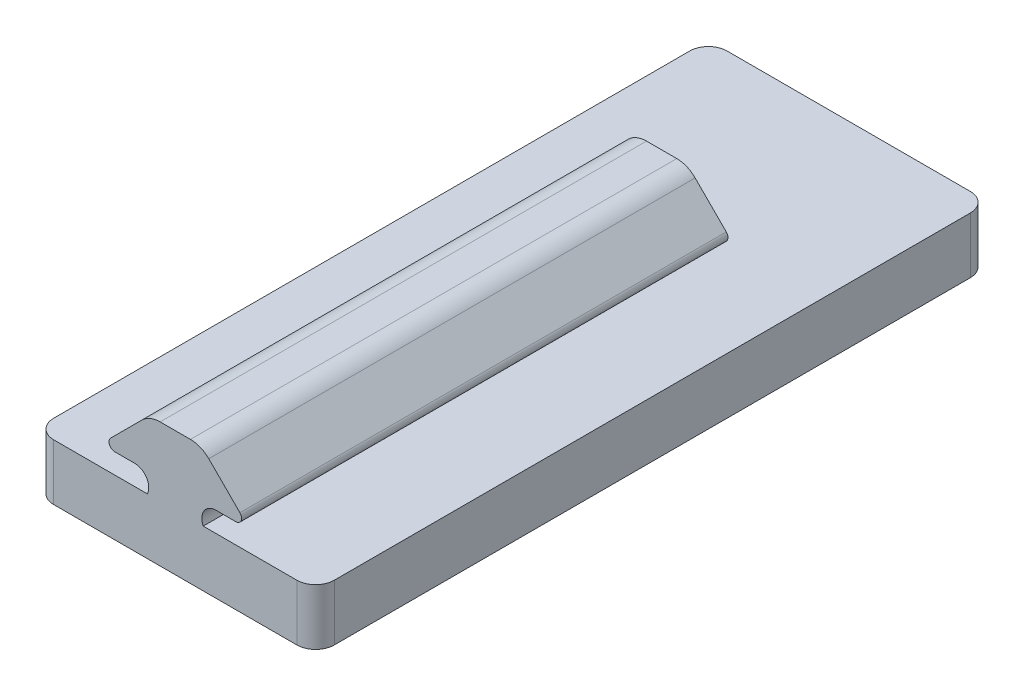
ISO-10303-21;
HEADER;
FILE_DESCRIPTION(('STEP AP214'),'2;1');
FILE_NAME('part.step','',(''),(''),'','','');
FILE_SCHEMA(('AUTOMOTIVE_DESIGN { 1 0 10303 214 1 1 1 1 }'));
ENDSEC;
DATA;
#1=APPLICATION_CONTEXT('core data for automotive mechanical design processes');
#2=APPLICATION_PROTOCOL_DEFINITION('international standard','automotive_design',2000,#1);
#3=PRODUCT_CONTEXT('',#1,'mechanical');
#4=PRODUCT('Part','Part','',(#3));
#5=PRODUCT_RELATED_PRODUCT_CATEGORY('part','',(#4));
#6=PRODUCT_DEFINITION_FORMATION('','',#4);
#7=PRODUCT_DEFINITION_CONTEXT('part definition',#1,'design');
#8=PRODUCT_DEFINITION('design','',#6,#7);
#9=PRODUCT_DEFINITION_SHAPE('','',#8);
#10=(LENGTH_UNIT() NAMED_UNIT(*) SI_UNIT(.MILLI.,.METRE.));
#11=(NAMED_UNIT(*) PLANE_ANGLE_UNIT() SI_UNIT($,.RADIAN.));
#12=(NAMED_UNIT(*) SI_UNIT($,.STERADIAN.) SOLID_ANGLE_UNIT());
#13=UNCERTAINTY_MEASURE_WITH_UNIT(LENGTH_MEASURE(1.E-05),#10,'distance_accuracy_value','');
#14=(GEOMETRIC_REPRESENTATION_CONTEXT(3) GLOBAL_UNCERTAINTY_ASSIGNED_CONTEXT((#13)) GLOBAL_UNIT_ASSIGNED_CONTEXT((#10,
#11,#12)) REPRESENTATION_CONTEXT('',''));
#15=CARTESIAN_POINT('',(0.,0.,0.));
#16=DIRECTION('',(0.,0.,1.));
#17=DIRECTION('',(1.,0.,0.));
#18=AXIS2_PLACEMENT_3D('',#15,#16,#17);
#19=CARTESIAN_POINT('',(13.,6.,-34.));
#20=DIRECTION('',(0.,-1.,0.));
#21=DIRECTION('',(0.,0.,-1.));
#22=AXIS2_PLACEMENT_3D('',#19,#20,#21);
#23=PLANE('',#22);
#24=DIRECTION('',(0.,0.,1.));
#25=VECTOR('',#24,1.);
#26=CARTESIAN_POINT('',(-2.98550279974351,6.,-16.));
#27=LINE('',#26,#25);
#28=CARTESIAN_POINT('',(-2.98550279974351,6.,-16.));
#29=VERTEX_POINT('',#28);
#30=CARTESIAN_POINT('',(-2.98550279974351,6.,36.));
#31=VERTEX_POINT('',#30);
#32=EDGE_CURVE('E12',#29,#31,#27,.T.);
#33=ORIENTED_EDGE('',*,*,#32,.F.);
#34=DIRECTION('',(-1.,0.,0.));
#35=VECTOR('',#34,1.);
#36=CARTESIAN_POINT('',(13.,6.,-16.));
#37=LINE('',#36,#35);
#38=CARTESIAN_POINT('',(2.98629677256727,6.,-16.));
#39=VERTEX_POINT('',#38);
#40=EDGE_CURVE('E288',#39,#29,#37,.T.);
#41=ORIENTED_EDGE('',*,*,#40,.F.);
#42=DIRECTION('',(0.,0.,1.));
#43=VECTOR('',#42,1.);
#44=CARTESIAN_POINT('',(2.98629677256727,6.,-16.));
#45=LINE('',#44,#43);
#46=CARTESIAN_POINT('',(2.98629677256727,6.,36.));
#47=VERTEX_POINT('',#46);
#48=EDGE_CURVE('E281',#47,#39,#45,.F.);
#49=ORIENTED_EDGE('',*,*,#48,.F.);
#50=DIRECTION('',(1.,0.,0.));
#51=VECTOR('',#50,1.);
#52=CARTESIAN_POINT('',(-13.,6.,36.));
#53=LINE('',#52,#51);
#54=CARTESIAN_POINT('',(13.,6.,36.));
#55=VERTEX_POINT('',#54);
#56=EDGE_CURVE('E524',#47,#55,#53,.T.);
#57=ORIENTED_EDGE('',*,*,#56,.T.);
#58=CARTESIAN_POINT('',(13.,6.,34.));
#59=DIRECTION('',(0.,1.,0.));
#60=DIRECTION('',(0.,0.,1.));
#61=AXIS2_PLACEMENT_3D('',#58,#59,#60);
#62=CIRCLE('',#61,2.);
#63=CARTESIAN_POINT('',(15.,6.,34.));
#64=VERTEX_POINT('',#63);
#65=EDGE_CURVE('E527',#55,#64,#62,.T.);
#66=ORIENTED_EDGE('',*,*,#65,.T.);
#67=DIRECTION('',(0.,0.,-1.));
#68=VECTOR('',#67,1.);
#69=CARTESIAN_POINT('',(15.,6.,-34.));
#70=LINE('',#69,#68);
#71=CARTESIAN_POINT('',(15.,6.,-34.));
#72=VERTEX_POINT('',#71);
#73=EDGE_CURVE('E529',#64,#72,#70,.T.);
#74=ORIENTED_EDGE('',*,*,#73,.T.);
#75=CARTESIAN_POINT('',(13.,6.,-34.));
#76=DIRECTION('',(0.,1.,0.));
#77=DIRECTION('',(0.,0.,-1.));
#78=AXIS2_PLACEMENT_3D('',#75,#76,#77);
#79=CIRCLE('',#78,2.);
#80=CARTESIAN_POINT('',(13.,6.,-36.));
#81=VERTEX_POINT('',#80);
#82=EDGE_CURVE('E512',#72,#81,#79,.T.);
#83=ORIENTED_EDGE('',*,*,#82,.T.);
#84=DIRECTION('',(-1.,0.,0.));
#85=VECTOR('',#84,1.);
#86=CARTESIAN_POINT('',(-13.,6.,-36.));
#87=LINE('',#86,#85);
#88=CARTESIAN_POINT('',(-13.,6.,-36.));
#89=VERTEX_POINT('',#88);
#90=EDGE_CURVE('E515',#81,#89,#87,.T.);
#91=ORIENTED_EDGE('',*,*,#90,.T.);
#92=CARTESIAN_POINT('',(-13.,6.,-34.));
#93=DIRECTION('',(0.,1.,0.));
#94=DIRECTION('',(0.,0.,1.));
#95=AXIS2_PLACEMENT_3D('',#92,#93,#94);
#96=CIRCLE('',#95,2.);
#97=CARTESIAN_POINT('',(-15.,6.,-34.));
#98=VERTEX_POINT('',#97);
#99=EDGE_CURVE('E518',#89,#98,#96,.T.);
#100=ORIENTED_EDGE('',*,*,#99,.T.);
#101=DIRECTION('',(0.,0.,1.));
#102=VECTOR('',#101,1.);
#103=CARTESIAN_POINT('',(-15.,6.,-34.));
#104=LINE('',#103,#102);
#105=CARTESIAN_POINT('',(-15.,6.,34.));
#106=VERTEX_POINT('',#105);
#107=EDGE_CURVE('E520',#98,#106,#104,.T.);
#108=ORIENTED_EDGE('',*,*,#107,.T.);
#109=CARTESIAN_POINT('',(-13.,6.,34.));
#110=DIRECTION('',(0.,1.,0.));
#111=DIRECTION('',(0.,0.,1.));
#112=AXIS2_PLACEMENT_3D('',#109,#110,#111);
#113=CIRCLE('',#112,2.);
#114=CARTESIAN_POINT('',(-13.,6.,36.));
#115=VERTEX_POINT('',#114);
#116=EDGE_CURVE('E522',#106,#115,#113,.T.);
#117=ORIENTED_EDGE('',*,*,#116,.T.);
#118=EDGE_CURVE('E525',#115,#31,#53,.T.);
#119=ORIENTED_EDGE('',*,*,#118,.T.);
#120=EDGE_LOOP('',(#33,#41,#49,#57,#66,#74,#83,#91,#100,#108,#117,#119));
#121=FACE_BOUND('',#120,.T.);
#122=ADVANCED_FACE('F273',(#121),#23,.F.);
#123=CARTESIAN_POINT('',(13.,6.,-34.));
#124=DIRECTION('',(0.,-1.,0.));
#125=DIRECTION('',(0.,0.,-1.));
#126=AXIS2_PLACEMENT_3D('',#123,#124,#125);
#127=CYLINDRICAL_SURFACE('',#126,2.);
#128=CARTESIAN_POINT('',(13.,0.,-34.));
#129=DIRECTION('',(0.,1.,0.));
#130=DIRECTION('',(0.,0.,-1.));
#131=AXIS2_PLACEMENT_3D('',#128,#129,#130);
#132=CIRCLE('',#131,2.);
#133=CARTESIAN_POINT('',(15.,0.,-34.));
#134=VERTEX_POINT('',#133);
#135=CARTESIAN_POINT('',(13.,0.,-36.));
#136=VERTEX_POINT('',#135);
#137=EDGE_CURVE('E503',#134,#136,#132,.T.);
#138=ORIENTED_EDGE('',*,*,#137,.T.);
#139=DIRECTION('',(0.,-1.,0.));
#140=VECTOR('',#139,1.);
#141=CARTESIAN_POINT('',(13.,6.,-36.));
#142=LINE('',#141,#140);
#143=EDGE_CURVE('E567',#81,#136,#142,.T.);
#144=ORIENTED_EDGE('',*,*,#143,.F.);
#145=ORIENTED_EDGE('',*,*,#82,.F.);
#146=DIRECTION('',(0.,-1.,0.));
#147=VECTOR('',#146,1.);
#148=CARTESIAN_POINT('',(15.,6.,-34.));
#149=LINE('',#148,#147);
#150=EDGE_CURVE('E531',#72,#134,#149,.T.);
#151=ORIENTED_EDGE('',*,*,#150,.T.);
#152=EDGE_LOOP('',(#138,#144,#145,#151));
#153=FACE_BOUND('',#152,.T.);
#154=ADVANCED_FACE('F275',(#153),#127,.T.);
#155=CARTESIAN_POINT('',(-13.,6.,-36.));
#156=DIRECTION('',(0.,0.,1.));
#157=DIRECTION('',(1.,0.,0.));
#158=AXIS2_PLACEMENT_3D('',#155,#156,#157);
#159=PLANE('',#158);
#160=DIRECTION('',(-1.,0.,0.));
#161=VECTOR('',#160,1.);
#162=CARTESIAN_POINT('',(-13.,0.,-36.));
#163=LINE('',#162,#161);
#164=CARTESIAN_POINT('',(-13.,0.,-36.));
#165=VERTEX_POINT('',#164);
#166=EDGE_CURVE('E534',#136,#165,#163,.T.);
#167=ORIENTED_EDGE('',*,*,#166,.T.);
#168=DIRECTION('',(0.,-1.,0.));
#169=VECTOR('',#168,1.);
#170=CARTESIAN_POINT('',(-13.,6.,-36.));
#171=LINE('',#170,#169);
#172=EDGE_CURVE('E564',#89,#165,#171,.T.);
#173=ORIENTED_EDGE('',*,*,#172,.F.);
#174=ORIENTED_EDGE('',*,*,#90,.F.);
#175=ORIENTED_EDGE('',*,*,#143,.T.);
#176=EDGE_LOOP('',(#167,#173,#174,#175));
#177=FACE_BOUND('',#176,.T.);
#178=ADVANCED_FACE('F624',(#177),#159,.F.);
#179=CARTESIAN_POINT('',(-13.,6.,-34.));
#180=DIRECTION('',(0.,-1.,0.));
#181=DIRECTION('',(0.,0.,-1.));
#182=AXIS2_PLACEMENT_3D('',#179,#180,#181);
#183=CYLINDRICAL_SURFACE('',#182,2.);
#184=CARTESIAN_POINT('',(-13.,0.,-34.));
#185=DIRECTION('',(0.,1.,0.));
#186=DIRECTION('',(0.,0.,1.));
#187=AXIS2_PLACEMENT_3D('',#184,#185,#186);
#188=CIRCLE('',#187,2.);
#189=CARTESIAN_POINT('',(-15.,0.,-34.));
#190=VERTEX_POINT('',#189);
#191=EDGE_CURVE('E536',#165,#190,#188,.T.);
#192=ORIENTED_EDGE('',*,*,#191,.T.);
#193=DIRECTION('',(0.,-1.,0.));
#194=VECTOR('',#193,1.);
#195=CARTESIAN_POINT('',(-15.,6.,-34.));
#196=LINE('',#195,#194);
#197=EDGE_CURVE('E561',#98,#190,#196,.T.);
#198=ORIENTED_EDGE('',*,*,#197,.F.);
#199=ORIENTED_EDGE('',*,*,#99,.F.);
#200=ORIENTED_EDGE('',*,*,#172,.T.);
#201=EDGE_LOOP('',(#192,#198,#199,#200));
#202=FACE_BOUND('',#201,.T.);
#203=ADVANCED_FACE('F651',(#202),#183,.T.);
#204=CARTESIAN_POINT('',(-15.,6.,-34.));
#205=DIRECTION('',(1.,0.,0.));
#206=DIRECTION('',(0.,0.,-1.));
#207=AXIS2_PLACEMENT_3D('',#204,#205,#206);
#208=PLANE('',#207);
#209=DIRECTION('',(0.,0.,1.));
#210=VECTOR('',#209,1.);
#211=CARTESIAN_POINT('',(-15.,0.,-34.));
#212=LINE('',#211,#210);
#213=CARTESIAN_POINT('',(-15.,0.,34.));
#214=VERTEX_POINT('',#213);
#215=EDGE_CURVE('E538',#190,#214,#212,.T.);
#216=ORIENTED_EDGE('',*,*,#215,.T.);
#217=DIRECTION('',(0.,-1.,0.));
#218=VECTOR('',#217,1.);
#219=CARTESIAN_POINT('',(-15.,6.,34.));
#220=LINE('',#219,#218);
#221=EDGE_CURVE('E558',#106,#214,#220,.T.);
#222=ORIENTED_EDGE('',*,*,#221,.F.);
#223=ORIENTED_EDGE('',*,*,#107,.F.);
#224=ORIENTED_EDGE('',*,*,#197,.T.);
#225=EDGE_LOOP('',(#216,#222,#223,#224));
#226=FACE_BOUND('',#225,.T.);
#227=ADVANCED_FACE('F647',(#226),#208,.F.);
#228=CARTESIAN_POINT('',(-13.,6.,34.));
#229=DIRECTION('',(0.,-1.,0.));
#230=DIRECTION('',(0.,0.,-1.));
#231=AXIS2_PLACEMENT_3D('',#228,#229,#230);
#232=CYLINDRICAL_SURFACE('',#231,2.);
#233=CARTESIAN_POINT('',(-13.,0.,34.));
#234=DIRECTION('',(0.,1.,0.));
#235=DIRECTION('',(0.,0.,1.));
#236=AXIS2_PLACEMENT_3D('',#233,#234,#235);
#237=CIRCLE('',#236,2.);
#238=CARTESIAN_POINT('',(-13.,0.,36.));
#239=VERTEX_POINT('',#238);
#240=EDGE_CURVE('E540',#214,#239,#237,.T.);
#241=ORIENTED_EDGE('',*,*,#240,.T.);
#242=DIRECTION('',(0.,-1.,0.));
#243=VECTOR('',#242,1.);
#244=CARTESIAN_POINT('',(-13.,6.,36.));
#245=LINE('',#244,#243);
#246=EDGE_CURVE('E555',#115,#239,#245,.T.);
#247=ORIENTED_EDGE('',*,*,#246,.F.);
#248=ORIENTED_EDGE('',*,*,#116,.F.);
#249=ORIENTED_EDGE('',*,*,#221,.T.);
#250=EDGE_LOOP('',(#241,#247,#248,#249));
#251=FACE_BOUND('',#250,.T.);
#252=ADVANCED_FACE('F644',(#251),#232,.T.);
#253=CARTESIAN_POINT('',(-13.,6.,36.));
#254=DIRECTION('',(0.,0.,-1.));
#255=DIRECTION('',(-1.,0.,0.));
#256=AXIS2_PLACEMENT_3D('',#253,#254,#255);
#257=PLANE('',#256);
#258=ORIENTED_EDGE('',*,*,#56,.F.);
#259=CARTESIAN_POINT('',(4.34379697192583,6.64955155202761,36.));
#260=DIRECTION('',(0.,0.,-1.));
#261=DIRECTION('',(-1.,0.,0.));
#262=AXIS2_PLACEMENT_3D('',#259,#260,#261);
#263=CIRCLE('',#262,1.50490000000001);
#264=CARTESIAN_POINT('',(4.34379697192584,8.15445155202763,36.));
#265=VERTEX_POINT('',#264);
#266=EDGE_CURVE('E454',#47,#265,#263,.T.);
#267=ORIENTED_EDGE('',*,*,#266,.T.);
#268=DIRECTION('',(1.,0.,0.));
#269=VECTOR('',#268,1.);
#270=CARTESIAN_POINT('',(6.47519145646088,8.15445155202763,36.));
#271=LINE('',#270,#269);
#272=CARTESIAN_POINT('',(6.47519145646088,8.15445155202762,36.));
#273=VERTEX_POINT('',#272);
#274=EDGE_CURVE('E451',#265,#273,#271,.T.);
#275=ORIENTED_EDGE('',*,*,#274,.T.);
#276=CARTESIAN_POINT('',(6.47519145646088,8.77045155202761,36.));
#277=DIRECTION('',(0.,0.,-1.));
#278=DIRECTION('',(-1.,0.,0.));
#279=AXIS2_PLACEMENT_3D('',#276,#277,#278);
#280=CIRCLE('',#279,0.615999999999986);
#281=CARTESIAN_POINT('',(6.91076923367177,9.20602932923854,36.));
#282=VERTEX_POINT('',#281);
#283=EDGE_CURVE('E448',#282,#273,#280,.T.);
#284=ORIENTED_EDGE('',*,*,#283,.F.);
#285=DIRECTION('',(-0.707106781186548,0.707106781186548,0.));
#286=VECTOR('',#285,1.);
#287=CARTESIAN_POINT('',(3.58072569309012,12.5360728698202,36.));
#288=LINE('',#287,#286);
#289=CARTESIAN_POINT('',(3.58072569309012,12.5360728698202,36.));
#290=VERTEX_POINT('',#289);
#291=EDGE_CURVE('E445',#282,#290,#288,.T.);
#292=ORIENTED_EDGE('',*,*,#291,.T.);
#293=CARTESIAN_POINT('',(1.61850437529722,10.5738515520273,36.));
#294=DIRECTION('',(0.,0.,-1.));
#295=DIRECTION('',(-1.,0.,0.));
#296=AXIS2_PLACEMENT_3D('',#293,#294,#295);
#297=CIRCLE('',#296,2.77500000000032);
#298=CARTESIAN_POINT('',(1.61850437529733,13.3488515520276,36.));
#299=VERTEX_POINT('',#298);
#300=EDGE_CURVE('E442',#299,#290,#297,.T.);
#301=ORIENTED_EDGE('',*,*,#300,.F.);
#302=DIRECTION('',(-1.,0.,0.));
#303=VECTOR('',#302,1.);
#304=CARTESIAN_POINT('',(-1.61771037350136,13.3488515520276,36.));
#305=LINE('',#304,#303);
#306=CARTESIAN_POINT('',(-1.61771037350136,13.3488515520276,36.));
#307=VERTEX_POINT('',#306);
#308=EDGE_CURVE('E439',#299,#307,#305,.T.);
#309=ORIENTED_EDGE('',*,*,#308,.T.);
#310=CARTESIAN_POINT('',(-1.61771037350136,10.5738515520273,36.));
#311=DIRECTION('',(0.,0.,-1.));
#312=DIRECTION('',(-1.,0.,0.));
#313=AXIS2_PLACEMENT_3D('',#310,#311,#312);
#314=CIRCLE('',#313,2.77500000000029);
#315=CARTESIAN_POINT('',(-3.57993169129422,12.5360728698201,36.));
#316=VERTEX_POINT('',#315);
#317=EDGE_CURVE('E436',#316,#307,#314,.T.);
#318=ORIENTED_EDGE('',*,*,#317,.F.);
#319=DIRECTION('',(-0.707106781186548,-0.707106781186547,0.));
#320=VECTOR('',#319,1.);
#321=CARTESIAN_POINT('',(-6.90997523187589,9.20602932923848,36.));
#322=LINE('',#321,#320);
#323=CARTESIAN_POINT('',(-6.90997523187591,9.2060293292385,36.));
#324=VERTEX_POINT('',#323);
#325=EDGE_CURVE('E434',#316,#324,#322,.T.);
#326=ORIENTED_EDGE('',*,*,#325,.T.);
#327=CARTESIAN_POINT('',(-6.47439745466502,8.77045155202761,36.));
#328=DIRECTION('',(0.,0.,-1.));
#329=DIRECTION('',(-1.,0.,0.));
#330=AXIS2_PLACEMENT_3D('',#327,#328,#329);
#331=CIRCLE('',#330,0.615999999999973);
#332=CARTESIAN_POINT('',(-6.47439745466496,8.1544515520276,36.));
#333=VERTEX_POINT('',#332);
#334=EDGE_CURVE('E428',#333,#324,#331,.T.);
#335=ORIENTED_EDGE('',*,*,#334,.F.);
#336=DIRECTION('',(1.,0.,0.));
#337=VECTOR('',#336,1.);
#338=CARTESIAN_POINT('',(-4.34300299910207,8.1544515520276,36.));
#339=LINE('',#338,#337);
#340=CARTESIAN_POINT('',(-4.34300299910207,8.1544515520276,36.));
#341=VERTEX_POINT('',#340);
#342=EDGE_CURVE('E412',#333,#341,#339,.T.);
#343=ORIENTED_EDGE('',*,*,#342,.T.);
#344=CARTESIAN_POINT('',(-4.34300299910207,6.64955155202761,36.));
#345=DIRECTION('',(0.,0.,-1.));
#346=DIRECTION('',(-1.,0.,0.));
#347=AXIS2_PLACEMENT_3D('',#344,#345,#346);
#348=CIRCLE('',#347,1.5049);
#349=EDGE_CURVE('E425',#341,#31,#348,.T.);
#350=ORIENTED_EDGE('',*,*,#349,.T.);
#351=ORIENTED_EDGE('',*,*,#118,.F.);
#352=ORIENTED_EDGE('',*,*,#246,.T.);
#353=DIRECTION('',(1.,0.,0.));
#354=VECTOR('',#353,1.);
#355=CARTESIAN_POINT('',(-13.,0.,36.));
#356=LINE('',#355,#354);
#357=CARTESIAN_POINT('',(13.,0.,36.));
#358=VERTEX_POINT('',#357);
#359=EDGE_CURVE('E542',#239,#358,#356,.T.);
#360=ORIENTED_EDGE('',*,*,#359,.T.);
#361=DIRECTION('',(0.,-1.,0.));
#362=VECTOR('',#361,1.);
#363=CARTESIAN_POINT('',(13.,6.,36.));
#364=LINE('',#363,#362);
#365=EDGE_CURVE('E552',#55,#358,#364,.T.);
#366=ORIENTED_EDGE('',*,*,#365,.F.);
#367=EDGE_LOOP('',(#258,#267,#275,#284,#292,#301,#309,#318,#326,#335,#343,#350,#351,#352,#360,#366));
#368=FACE_BOUND('',#367,.T.);
#369=ADVANCED_FACE('F423',(#368),#257,.F.);
#370=CARTESIAN_POINT('',(13.,6.,34.));
#371=DIRECTION('',(0.,-1.,0.));
#372=DIRECTION('',(0.,0.,-1.));
#373=AXIS2_PLACEMENT_3D('',#370,#371,#372);
#374=CYLINDRICAL_SURFACE('',#373,2.);
#375=CARTESIAN_POINT('',(13.,0.,34.));
#376=DIRECTION('',(0.,1.,0.));
#377=DIRECTION('',(0.,0.,1.));
#378=AXIS2_PLACEMENT_3D('',#375,#376,#377);
#379=CIRCLE('',#378,2.);
#380=CARTESIAN_POINT('',(15.,0.,34.));
#381=VERTEX_POINT('',#380);
#382=EDGE_CURVE('E544',#358,#381,#379,.T.);
#383=ORIENTED_EDGE('',*,*,#382,.T.);
#384=DIRECTION('',(0.,-1.,0.));
#385=VECTOR('',#384,1.);
#386=CARTESIAN_POINT('',(15.,6.,34.));
#387=LINE('',#386,#385);
#388=EDGE_CURVE('E549',#64,#381,#387,.T.);
#389=ORIENTED_EDGE('',*,*,#388,.F.);
#390=ORIENTED_EDGE('',*,*,#65,.F.);
#391=ORIENTED_EDGE('',*,*,#365,.T.);
#392=EDGE_LOOP('',(#383,#389,#390,#391));
#393=FACE_BOUND('',#392,.T.);
#394=ADVANCED_FACE('F637',(#393),#374,.T.);
#395=CARTESIAN_POINT('',(15.,6.,-34.));
#396=DIRECTION('',(-1.,0.,0.));
#397=DIRECTION('',(0.,0.,1.));
#398=AXIS2_PLACEMENT_3D('',#395,#396,#397);
#399=PLANE('',#398);
#400=DIRECTION('',(0.,0.,-1.));
#401=VECTOR('',#400,1.);
#402=CARTESIAN_POINT('',(15.,0.,-34.));
#403=LINE('',#402,#401);
#404=EDGE_CURVE('E516',#381,#134,#403,.T.);
#405=ORIENTED_EDGE('',*,*,#404,.T.);
#406=ORIENTED_EDGE('',*,*,#150,.F.);
#407=ORIENTED_EDGE('',*,*,#73,.F.);
#408=ORIENTED_EDGE('',*,*,#388,.T.);
#409=EDGE_LOOP('',(#405,#406,#407,#408));
#410=FACE_BOUND('',#409,.T.);
#411=ADVANCED_FACE('F633',(#410),#399,.F.);
#412=CARTESIAN_POINT('',(13.,0.,-34.));
#413=DIRECTION('',(0.,-1.,0.));
#414=DIRECTION('',(0.,0.,-1.));
#415=AXIS2_PLACEMENT_3D('',#412,#413,#414);
#416=PLANE('',#415);
#417=CARTESIAN_POINT('',(0.,0.,-24.));
#418=DIRECTION('',(0.,1.,0.));
#419=DIRECTION('',(0.,0.,1.));
#420=AXIS2_PLACEMENT_3D('',#417,#418,#419);
#421=CIRCLE('',#420,4.);
#422=CARTESIAN_POINT('',(0.,0.,-20.));
#423=VERTEX_POINT('',#422);
#424=EDGE_CURVE('E504',#423,#423,#421,.T.);
#425=ORIENTED_EDGE('',*,*,#424,.T.);
#426=EDGE_LOOP('',(#425));
#427=FACE_BOUND('',#426,.T.);
#428=CARTESIAN_POINT('',(0.,0.,24.));
#429=DIRECTION('',(0.,1.,0.));
#430=DIRECTION('',(0.,0.,1.));
#431=AXIS2_PLACEMENT_3D('',#428,#429,#430);
#432=CIRCLE('',#431,4.);
#433=CARTESIAN_POINT('',(0.,0.,28.));
#434=VERTEX_POINT('',#433);
#435=EDGE_CURVE('E417',#434,#434,#432,.T.);
#436=ORIENTED_EDGE('',*,*,#435,.T.);
#437=EDGE_LOOP('',(#436));
#438=FACE_BOUND('',#437,.T.);
#439=ORIENTED_EDGE('',*,*,#137,.F.);
#440=ORIENTED_EDGE('',*,*,#404,.F.);
#441=ORIENTED_EDGE('',*,*,#382,.F.);
#442=ORIENTED_EDGE('',*,*,#359,.F.);
#443=ORIENTED_EDGE('',*,*,#240,.F.);
#444=ORIENTED_EDGE('',*,*,#215,.F.);
#445=ORIENTED_EDGE('',*,*,#191,.F.);
#446=ORIENTED_EDGE('',*,*,#166,.F.);
#447=EDGE_LOOP('',(#439,#440,#441,#442,#443,#444,#445,#446));
#448=FACE_BOUND('',#447,.T.);
#449=ADVANCED_FACE('F630',(#427,#438,#448),#416,.T.);
#450=CARTESIAN_POINT('',(0.,2.,24.));
#451=DIRECTION('',(0.,-1.,0.));
#452=DIRECTION('',(0.,0.,-1.));
#453=AXIS2_PLACEMENT_3D('',#450,#451,#452);
#454=CYLINDRICAL_SURFACE('',#453,4.);
#455=CARTESIAN_POINT('',(0.,2.,24.));
#456=DIRECTION('',(0.,1.,0.));
#457=DIRECTION('',(0.,0.,1.));
#458=AXIS2_PLACEMENT_3D('',#455,#456,#457);
#459=CIRCLE('',#458,4.);
#460=CARTESIAN_POINT('',(0.,2.,28.));
#461=VERTEX_POINT('',#460);
#462=EDGE_CURVE('E507',#461,#461,#459,.T.);
#463=ORIENTED_EDGE('',*,*,#462,.T.);
#464=EDGE_LOOP('',(#463));
#465=FACE_BOUND('',#464,.T.);
#466=ORIENTED_EDGE('',*,*,#435,.F.);
#467=EDGE_LOOP('',(#466));
#468=FACE_BOUND('',#467,.T.);
#469=ADVANCED_FACE('F628',(#465,#468),#454,.F.);
#470=CARTESIAN_POINT('',(0.,2.,24.));
#471=DIRECTION('',(0.,1.,0.));
#472=DIRECTION('',(0.,0.,1.));
#473=AXIS2_PLACEMENT_3D('',#470,#471,#472);
#474=PLANE('',#473);
#475=ORIENTED_EDGE('',*,*,#462,.F.);
#476=EDGE_LOOP('',(#475));
#477=FACE_BOUND('',#476,.T.);
#478=ADVANCED_FACE('F718',(#477),#474,.F.);
#479=CARTESIAN_POINT('',(0.,2.,-24.));
#480=DIRECTION('',(0.,-1.,0.));
#481=DIRECTION('',(0.,0.,-1.));
#482=AXIS2_PLACEMENT_3D('',#479,#480,#481);
#483=CYLINDRICAL_SURFACE('',#482,4.);
#484=CARTESIAN_POINT('',(0.,2.,-24.));
#485=DIRECTION('',(0.,1.,0.));
#486=DIRECTION('',(0.,0.,1.));
#487=AXIS2_PLACEMENT_3D('',#484,#485,#486);
#488=CIRCLE('',#487,4.);
#489=CARTESIAN_POINT('',(0.,2.,-20.));
#490=VERTEX_POINT('',#489);
#491=EDGE_CURVE('E500',#490,#490,#488,.T.);
#492=ORIENTED_EDGE('',*,*,#491,.T.);
#493=EDGE_LOOP('',(#492));
#494=FACE_BOUND('',#493,.T.);
#495=ORIENTED_EDGE('',*,*,#424,.F.);
#496=EDGE_LOOP('',(#495));
#497=FACE_BOUND('',#496,.T.);
#498=ADVANCED_FACE('F725',(#494,#497),#483,.F.);
#499=CARTESIAN_POINT('',(0.,2.,-24.));
#500=DIRECTION('',(0.,1.,0.));
#501=DIRECTION('',(0.,0.,1.));
#502=AXIS2_PLACEMENT_3D('',#499,#500,#501);
#503=PLANE('',#502);
#504=ORIENTED_EDGE('',*,*,#491,.F.);
#505=EDGE_LOOP('',(#504));
#506=FACE_BOUND('',#505,.T.);
#507=ADVANCED_FACE('F732',(#506),#503,.F.);
#508=CARTESIAN_POINT('',(-4.34300299910207,6.64955155202761,-16.));
#509=DIRECTION('',(0.,0.,1.));
#510=DIRECTION('',(1.,0.,0.));
#511=AXIS2_PLACEMENT_3D('',#508,#509,#510);
#512=CYLINDRICAL_SURFACE('',#511,1.5049);
#513=CARTESIAN_POINT('',(-4.34300299910207,6.64955155202761,-16.));
#514=DIRECTION('',(0.,0.,1.));
#515=DIRECTION('',(1.,0.,0.));
#516=AXIS2_PLACEMENT_3D('',#513,#514,#515);
#517=CIRCLE('',#516,1.5049);
#518=CARTESIAN_POINT('',(-4.34300299910207,8.1544515520276,-16.));
#519=VERTEX_POINT('',#518);
#520=EDGE_CURVE('E480',#29,#519,#517,.T.);
#521=ORIENTED_EDGE('',*,*,#520,.F.);
#522=ORIENTED_EDGE('',*,*,#32,.T.);
#523=ORIENTED_EDGE('',*,*,#349,.F.);
#524=DIRECTION('',(0.,0.,1.));
#525=VECTOR('',#524,1.);
#526=CARTESIAN_POINT('',(-4.34300299910207,8.1544515520276,-16.));
#527=LINE('',#526,#525);
#528=EDGE_CURVE('E408',#519,#341,#527,.T.);
#529=ORIENTED_EDGE('',*,*,#528,.F.);
#530=EDGE_LOOP('',(#521,#522,#523,#529));
#531=FACE_BOUND('',#530,.T.);
#532=ADVANCED_FACE('F430',(#531),#512,.F.);
#533=CARTESIAN_POINT('',(4.34379697192583,6.64955155202761,-16.));
#534=DIRECTION('',(0.,0.,1.));
#535=DIRECTION('',(1.,0.,0.));
#536=AXIS2_PLACEMENT_3D('',#533,#534,#535);
#537=CYLINDRICAL_SURFACE('',#536,1.50490000000001);
#538=ORIENTED_EDGE('',*,*,#266,.F.);
#539=ORIENTED_EDGE('',*,*,#48,.T.);
#540=CARTESIAN_POINT('',(4.34379697192583,6.64955155202761,-16.));
#541=DIRECTION('',(0.,0.,1.));
#542=DIRECTION('',(1.,0.,0.));
#543=AXIS2_PLACEMENT_3D('',#540,#541,#542);
#544=CIRCLE('',#543,1.50490000000001);
#545=CARTESIAN_POINT('',(4.34379697192583,8.15445155202763,-16.));
#546=VERTEX_POINT('',#545);
#547=EDGE_CURVE('E456',#546,#39,#544,.T.);
#548=ORIENTED_EDGE('',*,*,#547,.F.);
#549=DIRECTION('',(0.,0.,1.));
#550=VECTOR('',#549,1.);
#551=CARTESIAN_POINT('',(4.34379697192583,8.15445155202763,-16.));
#552=LINE('',#551,#550);
#553=EDGE_CURVE('E481',#546,#265,#552,.T.);
#554=ORIENTED_EDGE('',*,*,#553,.T.);
#555=EDGE_LOOP('',(#538,#539,#548,#554));
#556=FACE_BOUND('',#555,.T.);
#557=ADVANCED_FACE('F573',(#556),#537,.F.);
#558=CARTESIAN_POINT('',(4.34379697192583,6.64955155202761,-16.));
#559=DIRECTION('',(0.,0.,1.));
#560=DIRECTION('',(1.,0.,0.));
#561=AXIS2_PLACEMENT_3D('',#558,#559,#560);
#562=PLANE('',#561);
#563=ORIENTED_EDGE('',*,*,#547,.T.);
#564=ORIENTED_EDGE('',*,*,#40,.T.);
#565=ORIENTED_EDGE('',*,*,#520,.T.);
#566=DIRECTION('',(-1.,0.,0.));
#567=VECTOR('',#566,1.);
#568=CARTESIAN_POINT('',(-4.34300299910207,8.1544515520276,-16.));
#569=LINE('',#568,#567);
#570=CARTESIAN_POINT('',(-6.47439745466497,8.1544515520276,-16.));
#571=VERTEX_POINT('',#570);
#572=EDGE_CURVE('E413',#519,#571,#569,.T.);
#573=ORIENTED_EDGE('',*,*,#572,.T.);
#574=CARTESIAN_POINT('',(-6.47439745466502,8.77045155202761,-16.));
#575=DIRECTION('',(0.,0.,1.));
#576=DIRECTION('',(1.,0.,0.));
#577=AXIS2_PLACEMENT_3D('',#574,#575,#576);
#578=CIRCLE('',#577,0.615999999999973);
#579=CARTESIAN_POINT('',(-6.90997523187591,9.2060293292385,-16.));
#580=VERTEX_POINT('',#579);
#581=EDGE_CURVE('E476',#580,#571,#578,.T.);
#582=ORIENTED_EDGE('',*,*,#581,.F.);
#583=DIRECTION('',(0.707106781186548,0.707106781186547,0.));
#584=VECTOR('',#583,1.);
#585=CARTESIAN_POINT('',(-6.90997523187589,9.20602932923848,-16.));
#586=LINE('',#585,#584);
#587=CARTESIAN_POINT('',(-3.57993169129422,12.5360728698201,-16.));
#588=VERTEX_POINT('',#587);
#589=EDGE_CURVE('E474',#580,#588,#586,.T.);
#590=ORIENTED_EDGE('',*,*,#589,.T.);
#591=CARTESIAN_POINT('',(-1.61771037350136,10.5738515520273,-16.));
#592=DIRECTION('',(0.,0.,1.));
#593=DIRECTION('',(1.,0.,0.));
#594=AXIS2_PLACEMENT_3D('',#591,#592,#593);
#595=CIRCLE('',#594,2.77500000000029);
#596=CARTESIAN_POINT('',(-1.61771037350136,13.3488515520276,-16.));
#597=VERTEX_POINT('',#596);
#598=EDGE_CURVE('E471',#597,#588,#595,.T.);
#599=ORIENTED_EDGE('',*,*,#598,.F.);
#600=DIRECTION('',(1.,0.,0.));
#601=VECTOR('',#600,1.);
#602=CARTESIAN_POINT('',(-1.61771037350136,13.3488515520276,-16.));
#603=LINE('',#602,#601);
#604=CARTESIAN_POINT('',(1.61850437529733,13.3488515520276,-16.));
#605=VERTEX_POINT('',#604);
#606=EDGE_CURVE('E469',#597,#605,#603,.T.);
#607=ORIENTED_EDGE('',*,*,#606,.T.);
#608=CARTESIAN_POINT('',(1.61850437529722,10.5738515520273,-16.));
#609=DIRECTION('',(0.,0.,1.));
#610=DIRECTION('',(1.,0.,0.));
#611=AXIS2_PLACEMENT_3D('',#608,#609,#610);
#612=CIRCLE('',#611,2.77500000000032);
#613=CARTESIAN_POINT('',(3.58072569309012,12.5360728698202,-16.));
#614=VERTEX_POINT('',#613);
#615=EDGE_CURVE('E466',#614,#605,#612,.T.);
#616=ORIENTED_EDGE('',*,*,#615,.F.);
#617=DIRECTION('',(0.707106781186547,-0.707106781186547,0.));
#618=VECTOR('',#617,1.);
#619=CARTESIAN_POINT('',(3.58072569309012,12.5360728698202,-16.));
#620=LINE('',#619,#618);
#621=CARTESIAN_POINT('',(6.91076923367177,9.20602932923854,-16.));
#622=VERTEX_POINT('',#621);
#623=EDGE_CURVE('E464',#614,#622,#620,.T.);
#624=ORIENTED_EDGE('',*,*,#623,.T.);
#625=CARTESIAN_POINT('',(6.47519145646088,8.77045155202761,-16.));
#626=DIRECTION('',(0.,0.,1.));
#627=DIRECTION('',(1.,0.,0.));
#628=AXIS2_PLACEMENT_3D('',#625,#626,#627);
#629=CIRCLE('',#628,0.615999999999986);
#630=CARTESIAN_POINT('',(6.47519145646088,8.15445155202762,-16.));
#631=VERTEX_POINT('',#630);
#632=EDGE_CURVE('E461',#631,#622,#629,.T.);
#633=ORIENTED_EDGE('',*,*,#632,.F.);
#634=DIRECTION('',(-1.,0.,0.));
#635=VECTOR('',#634,1.);
#636=CARTESIAN_POINT('',(6.47519145646088,8.15445155202763,-16.));
#637=LINE('',#636,#635);
#638=EDGE_CURVE('E459',#631,#546,#637,.T.);
#639=ORIENTED_EDGE('',*,*,#638,.T.);
#640=EDGE_LOOP('',(#563,#564,#565,#573,#582,#590,#599,#607,#616,#624,#633,#639));
#641=FACE_BOUND('',#640,.T.);
#642=ADVANCED_FACE('F575',(#641),#562,.F.);
#643=CARTESIAN_POINT('',(-4.34300299910207,8.1544515520276,-16.));
#644=DIRECTION('',(0.,1.,0.));
#645=DIRECTION('',(0.,0.,1.));
#646=AXIS2_PLACEMENT_3D('',#643,#644,#645);
#647=PLANE('',#646);
#648=ORIENTED_EDGE('',*,*,#528,.T.);
#649=ORIENTED_EDGE('',*,*,#342,.F.);
#650=DIRECTION('',(0.,0.,1.));
#651=VECTOR('',#650,1.);
#652=CARTESIAN_POINT('',(-6.47439745466497,8.1544515520276,-16.));
#653=LINE('',#652,#651);
#654=EDGE_CURVE('E418',#571,#333,#653,.T.);
#655=ORIENTED_EDGE('',*,*,#654,.F.);
#656=ORIENTED_EDGE('',*,*,#572,.F.);
#657=EDGE_LOOP('',(#648,#649,#655,#656));
#658=FACE_BOUND('',#657,.T.);
#659=ADVANCED_FACE('F410',(#658),#647,.F.);
#660=CARTESIAN_POINT('',(-6.47439745466502,8.77045155202761,-16.));
#661=DIRECTION('',(0.,0.,1.));
#662=DIRECTION('',(1.,0.,0.));
#663=AXIS2_PLACEMENT_3D('',#660,#661,#662);
#664=CYLINDRICAL_SURFACE('',#663,0.615999999999973);
#665=ORIENTED_EDGE('',*,*,#654,.T.);
#666=ORIENTED_EDGE('',*,*,#334,.T.);
#667=DIRECTION('',(0.,0.,1.));
#668=VECTOR('',#667,1.);
#669=CARTESIAN_POINT('',(-6.90997523187591,9.2060293292385,-16.));
#670=LINE('',#669,#668);
#671=EDGE_CURVE('E484',#580,#324,#670,.T.);
#672=ORIENTED_EDGE('',*,*,#671,.F.);
#673=ORIENTED_EDGE('',*,*,#581,.T.);
#674=EDGE_LOOP('',(#665,#666,#672,#673));
#675=FACE_BOUND('',#674,.T.);
#676=ADVANCED_FACE('F610',(#675),#664,.T.);
#677=CARTESIAN_POINT('',(-6.90997523187589,9.20602932923848,-16.));
#678=DIRECTION('',(0.707106781186547,-0.707106781186548,0.));
#679=DIRECTION('',(0.707106781186548,0.707106781186547,0.));
#680=AXIS2_PLACEMENT_3D('',#677,#678,#679);
#681=PLANE('',#680);
#682=ORIENTED_EDGE('',*,*,#671,.T.);
#683=ORIENTED_EDGE('',*,*,#325,.F.);
#684=DIRECTION('',(0.,0.,1.));
#685=VECTOR('',#684,1.);
#686=CARTESIAN_POINT('',(-3.57993169129422,12.5360728698201,-16.));
#687=LINE('',#686,#685);
#688=EDGE_CURVE('E486',#588,#316,#687,.T.);
#689=ORIENTED_EDGE('',*,*,#688,.F.);
#690=ORIENTED_EDGE('',*,*,#589,.F.);
#691=EDGE_LOOP('',(#682,#683,#689,#690));
#692=FACE_BOUND('',#691,.T.);
#693=ADVANCED_FACE('F607',(#692),#681,.F.);
#694=CARTESIAN_POINT('',(-1.61771037350136,10.5738515520273,-16.));
#695=DIRECTION('',(0.,0.,1.));
#696=DIRECTION('',(1.,0.,0.));
#697=AXIS2_PLACEMENT_3D('',#694,#695,#696);
#698=CYLINDRICAL_SURFACE('',#697,2.77500000000029);
#699=ORIENTED_EDGE('',*,*,#688,.T.);
#700=ORIENTED_EDGE('',*,*,#317,.T.);
#701=DIRECTION('',(0.,0.,1.));
#702=VECTOR('',#701,1.);
#703=CARTESIAN_POINT('',(-1.61771037350136,13.3488515520276,-16.));
#704=LINE('',#703,#702);
#705=EDGE_CURVE('E488',#597,#307,#704,.T.);
#706=ORIENTED_EDGE('',*,*,#705,.F.);
#707=ORIENTED_EDGE('',*,*,#598,.T.);
#708=EDGE_LOOP('',(#699,#700,#706,#707));
#709=FACE_BOUND('',#708,.T.);
#710=ADVANCED_FACE('F603',(#709),#698,.T.);
#711=CARTESIAN_POINT('',(-1.61771037350136,13.3488515520276,-16.));
#712=DIRECTION('',(0.,-1.,0.));
#713=DIRECTION('',(0.,0.,-1.));
#714=AXIS2_PLACEMENT_3D('',#711,#712,#713);
#715=PLANE('',#714);
#716=ORIENTED_EDGE('',*,*,#705,.T.);
#717=ORIENTED_EDGE('',*,*,#308,.F.);
#718=DIRECTION('',(0.,0.,1.));
#719=VECTOR('',#718,1.);
#720=CARTESIAN_POINT('',(1.61850437529733,13.3488515520276,-16.));
#721=LINE('',#720,#719);
#722=EDGE_CURVE('E490',#605,#299,#721,.T.);
#723=ORIENTED_EDGE('',*,*,#722,.F.);
#724=ORIENTED_EDGE('',*,*,#606,.F.);
#725=EDGE_LOOP('',(#716,#717,#723,#724));
#726=FACE_BOUND('',#725,.T.);
#727=ADVANCED_FACE('F598',(#726),#715,.F.);
#728=CARTESIAN_POINT('',(1.61850437529722,10.5738515520273,-16.));
#729=DIRECTION('',(0.,0.,1.));
#730=DIRECTION('',(1.,0.,0.));
#731=AXIS2_PLACEMENT_3D('',#728,#729,#730);
#732=CYLINDRICAL_SURFACE('',#731,2.77500000000032);
#733=ORIENTED_EDGE('',*,*,#722,.T.);
#734=ORIENTED_EDGE('',*,*,#300,.T.);
#735=DIRECTION('',(0.,0.,1.));
#736=VECTOR('',#735,1.);
#737=CARTESIAN_POINT('',(3.58072569309012,12.5360728698202,-16.));
#738=LINE('',#737,#736);
#739=EDGE_CURVE('E492',#614,#290,#738,.T.);
#740=ORIENTED_EDGE('',*,*,#739,.F.);
#741=ORIENTED_EDGE('',*,*,#615,.T.);
#742=EDGE_LOOP('',(#733,#734,#740,#741));
#743=FACE_BOUND('',#742,.T.);
#744=ADVANCED_FACE('F594',(#743),#732,.T.);
#745=CARTESIAN_POINT('',(3.58072569309012,12.5360728698202,-16.));
#746=DIRECTION('',(-0.707106781186547,-0.707106781186547,0.));
#747=DIRECTION('',(0.707106781186548,-0.707106781186548,0.));
#748=AXIS2_PLACEMENT_3D('',#745,#746,#747);
#749=PLANE('',#748);
#750=ORIENTED_EDGE('',*,*,#739,.T.);
#751=ORIENTED_EDGE('',*,*,#291,.F.);
#752=DIRECTION('',(0.,0.,1.));
#753=VECTOR('',#752,1.);
#754=CARTESIAN_POINT('',(6.91076923367177,9.20602932923854,-16.));
#755=LINE('',#754,#753);
#756=EDGE_CURVE('E494',#622,#282,#755,.T.);
#757=ORIENTED_EDGE('',*,*,#756,.F.);
#758=ORIENTED_EDGE('',*,*,#623,.F.);
#759=EDGE_LOOP('',(#750,#751,#757,#758));
#760=FACE_BOUND('',#759,.T.);
#761=ADVANCED_FACE('F589',(#760),#749,.F.);
#762=CARTESIAN_POINT('',(6.47519145646088,8.77045155202761,-16.));
#763=DIRECTION('',(0.,0.,1.));
#764=DIRECTION('',(1.,0.,0.));
#765=AXIS2_PLACEMENT_3D('',#762,#763,#764);
#766=CYLINDRICAL_SURFACE('',#765,0.615999999999986);
#767=ORIENTED_EDGE('',*,*,#756,.T.);
#768=ORIENTED_EDGE('',*,*,#283,.T.);
#769=DIRECTION('',(0.,0.,1.));
#770=VECTOR('',#769,1.);
#771=CARTESIAN_POINT('',(6.47519145646088,8.15445155202762,-16.));
#772=LINE('',#771,#770);
#773=EDGE_CURVE('E496',#631,#273,#772,.T.);
#774=ORIENTED_EDGE('',*,*,#773,.F.);
#775=ORIENTED_EDGE('',*,*,#632,.T.);
#776=EDGE_LOOP('',(#767,#768,#774,#775));
#777=FACE_BOUND('',#776,.T.);
#778=ADVANCED_FACE('F585',(#777),#766,.T.);
#779=CARTESIAN_POINT('',(6.47519145646088,8.15445155202763,-16.));
#780=DIRECTION('',(0.,1.,0.));
#781=DIRECTION('',(0.,0.,1.));
#782=AXIS2_PLACEMENT_3D('',#779,#780,#781);
#783=PLANE('',#782);
#784=ORIENTED_EDGE('',*,*,#773,.T.);
#785=ORIENTED_EDGE('',*,*,#274,.F.);
#786=ORIENTED_EDGE('',*,*,#553,.F.);
#787=ORIENTED_EDGE('',*,*,#638,.F.);
#788=EDGE_LOOP('',(#784,#785,#786,#787));
#789=FACE_BOUND('',#788,.T.);
#790=ADVANCED_FACE('F581',(#789),#783,.F.);
#791=CLOSED_SHELL('',(#122,#154,#178,#203,#227,#252,#369,#394,#411,#449,#469,#478,#498,#507,
#532,#557,#642,#659,#676,#693,#710,#727,#744,#761,#778,#790));
#792=MANIFOLD_SOLID_BREP('B2',#791);
#793=ADVANCED_BREP_SHAPE_REPRESENTATION('',(#18,#792),#14);
#794=SHAPE_DEFINITION_REPRESENTATION(#9,#793);
ENDSEC;
END-ISO-10303-21;
